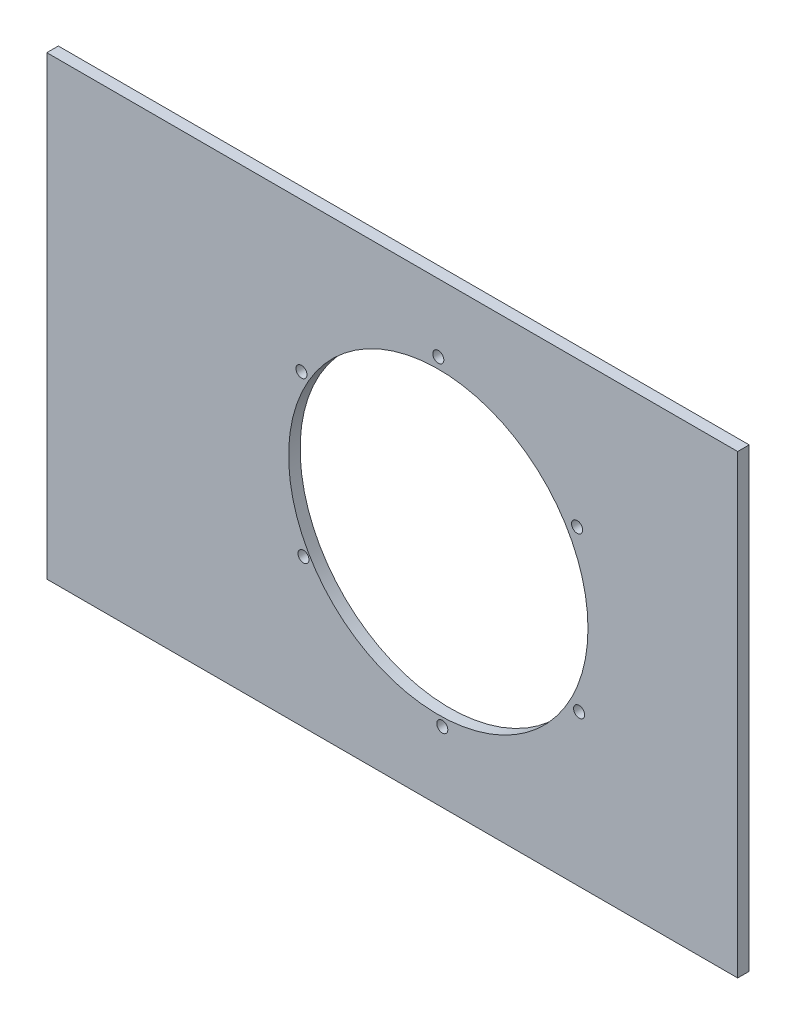
ISO-10303-21;
HEADER;
FILE_DESCRIPTION(('STEP AP214'),'2;1');
FILE_NAME('part.step','',(''),(''),'','','');
FILE_SCHEMA(('AUTOMOTIVE_DESIGN { 1 0 10303 214 1 1 1 1 }'));
ENDSEC;
DATA;
#1=APPLICATION_CONTEXT('core data for automotive mechanical design processes');
#2=APPLICATION_PROTOCOL_DEFINITION('international standard','automotive_design',2000,#1);
#3=PRODUCT_CONTEXT('',#1,'mechanical');
#4=PRODUCT('Part','Part','',(#3));
#5=PRODUCT_RELATED_PRODUCT_CATEGORY('part','',(#4));
#6=PRODUCT_DEFINITION_FORMATION('','',#4);
#7=PRODUCT_DEFINITION_CONTEXT('part definition',#1,'design');
#8=PRODUCT_DEFINITION('design','',#6,#7);
#9=PRODUCT_DEFINITION_SHAPE('','',#8);
#10=(LENGTH_UNIT() NAMED_UNIT(*) SI_UNIT(.MILLI.,.METRE.));
#11=(NAMED_UNIT(*) PLANE_ANGLE_UNIT() SI_UNIT($,.RADIAN.));
#12=(NAMED_UNIT(*) SI_UNIT($,.STERADIAN.) SOLID_ANGLE_UNIT());
#13=UNCERTAINTY_MEASURE_WITH_UNIT(LENGTH_MEASURE(1.E-05),#10,'distance_accuracy_value','');
#14=(GEOMETRIC_REPRESENTATION_CONTEXT(3) GLOBAL_UNCERTAINTY_ASSIGNED_CONTEXT((#13)) GLOBAL_UNIT_ASSIGNED_CONTEXT((#10,
#11,#12)) REPRESENTATION_CONTEXT('',''));
#15=CARTESIAN_POINT('',(0.,0.,0.));
#16=DIRECTION('',(0.,0.,1.));
#17=DIRECTION('',(1.,0.,0.));
#18=AXIS2_PLACEMENT_3D('',#15,#16,#17);
#19=CARTESIAN_POINT('',(0.,0.,6.35));
#20=DIRECTION('',(0.,0.,1.));
#21=DIRECTION('',(1.,0.,0.));
#22=AXIS2_PLACEMENT_3D('',#19,#20,#21);
#23=PLANE('',#22);
#24=CARTESIAN_POINT('',(-239.4500129657,81.5339999999987,6.35));
#25=DIRECTION('',(0.,0.,1.));
#26=DIRECTION('',(1.,0.,0.));
#27=AXIS2_PLACEMENT_3D('',#24,#25,#26);
#28=CIRCLE('',#27,3.04799999999998);
#29=CARTESIAN_POINT('',(-236.4020129657,81.5339999999987,6.35));
#30=VERTEX_POINT('',#29);
#31=EDGE_CURVE('E142',#30,#30,#28,.T.);
#32=ORIENTED_EDGE('',*,*,#31,.F.);
#33=EDGE_LOOP('',(#32));
#34=FACE_BOUND('',#33,.T.);
#35=CARTESIAN_POINT('',(-87.4504302458777,83.4390000000007,6.35));
#36=DIRECTION('',(0.,0.,1.));
#37=DIRECTION('',(1.,0.,0.));
#38=AXIS2_PLACEMENT_3D('',#35,#36,#37);
#39=CIRCLE('',#38,3.04800000000001);
#40=CARTESIAN_POINT('',(-84.4024302458777,83.4390000000007,6.35));
#41=VERTEX_POINT('',#40);
#42=EDGE_CURVE('E130',#41,#41,#39,.T.);
#43=ORIENTED_EDGE('',*,*,#42,.F.);
#44=EDGE_LOOP('',(#43));
#45=FACE_BOUND('',#44,.T.);
#46=CARTESIAN_POINT('',(-165.1,214.122,6.35));
#47=DIRECTION('',(0.,0.,1.));
#48=DIRECTION('',(1.,0.,0.));
#49=AXIS2_PLACEMENT_3D('',#46,#47,#48);
#50=CIRCLE('',#49,3.04799999999998);
#51=CARTESIAN_POINT('',(-162.052,214.122,6.35));
#52=VERTEX_POINT('',#51);
#53=EDGE_CURVE('E118',#52,#52,#50,.T.);
#54=ORIENTED_EDGE('',*,*,#53,.F.);
#55=EDGE_LOOP('',(#54));
#56=FACE_BOUND('',#55,.T.);
#57=DIRECTION('',(0.,1.,0.));
#58=VECTOR('',#57,1.);
#59=CARTESIAN_POINT('',(0.,0.,6.35));
#60=LINE('',#59,#58);
#61=CARTESIAN_POINT('',(0.,0.,6.35));
#62=VERTEX_POINT('',#61);
#63=CARTESIAN_POINT('',(0.,251.46,6.35));
#64=VERTEX_POINT('',#63);
#65=EDGE_CURVE('E88',#62,#64,#60,.T.);
#66=ORIENTED_EDGE('',*,*,#65,.T.);
#67=DIRECTION('',(-1.,0.,0.));
#68=VECTOR('',#67,1.);
#69=CARTESIAN_POINT('',(0.,251.46,6.35));
#70=LINE('',#69,#68);
#71=CARTESIAN_POINT('',(-381.,251.46,6.35));
#72=VERTEX_POINT('',#71);
#73=EDGE_CURVE('E83',#64,#72,#70,.T.);
#74=ORIENTED_EDGE('',*,*,#73,.T.);
#75=DIRECTION('',(0.,-1.,0.));
#76=VECTOR('',#75,1.);
#77=CARTESIAN_POINT('',(-381.,0.,6.35));
#78=LINE('',#77,#76);
#79=CARTESIAN_POINT('',(-381.,0.,6.35));
#80=VERTEX_POINT('',#79);
#81=EDGE_CURVE('E86',#72,#80,#78,.T.);
#82=ORIENTED_EDGE('',*,*,#81,.T.);
#83=DIRECTION('',(1.,0.,0.));
#84=VECTOR('',#83,1.);
#85=CARTESIAN_POINT('',(0.,0.,6.35));
#86=LINE('',#85,#84);
#87=EDGE_CURVE('E53',#80,#62,#86,.T.);
#88=ORIENTED_EDGE('',*,*,#87,.T.);
#89=EDGE_LOOP('',(#66,#74,#82,#88));
#90=FACE_BOUND('',#89,.T.);
#91=CARTESIAN_POINT('',(-165.1,125.73,6.35));
#92=DIRECTION('',(0.,0.,1.));
#93=DIRECTION('',(1.,0.,0.));
#94=AXIS2_PLACEMENT_3D('',#91,#92,#93);
#95=CIRCLE('',#94,82.55);
#96=CARTESIAN_POINT('',(-82.55,125.73,6.35));
#97=VERTEX_POINT('',#96);
#98=EDGE_CURVE('E103',#97,#97,#95,.T.);
#99=ORIENTED_EDGE('',*,*,#98,.F.);
#100=EDGE_LOOP('',(#99));
#101=FACE_BOUND('',#100,.T.);
#102=CARTESIAN_POINT('',(-88.5502825086851,171.196000000001,6.35));
#103=DIRECTION('',(0.,0.,1.));
#104=DIRECTION('',(1.,0.,0.));
#105=AXIS2_PLACEMENT_3D('',#102,#103,#104);
#106=CIRCLE('',#105,3.04799999999998);
#107=CARTESIAN_POINT('',(-85.5022825086852,171.196000000001,6.35));
#108=VERTEX_POINT('',#107);
#109=EDGE_CURVE('E124',#108,#108,#106,.T.);
#110=ORIENTED_EDGE('',*,*,#109,.F.);
#111=EDGE_LOOP('',(#110));
#112=FACE_BOUND('',#111,.T.);
#113=CARTESIAN_POINT('',(-162.900295474385,38.6079999999996,6.35));
#114=DIRECTION('',(0.,0.,1.));
#115=DIRECTION('',(1.,0.,0.));
#116=AXIS2_PLACEMENT_3D('',#113,#114,#115);
#117=CIRCLE('',#116,3.04799999999996);
#118=CARTESIAN_POINT('',(-159.852295474385,38.6079999999996,6.35));
#119=VERTEX_POINT('',#118);
#120=EDGE_CURVE('E136',#119,#119,#117,.T.);
#121=ORIENTED_EDGE('',*,*,#120,.F.);
#122=EDGE_LOOP('',(#121));
#123=FACE_BOUND('',#122,.T.);
#124=CARTESIAN_POINT('',(-240.549865228507,169.290999999999,6.35));
#125=DIRECTION('',(0.,0.,1.));
#126=DIRECTION('',(1.,0.,0.));
#127=AXIS2_PLACEMENT_3D('',#124,#125,#126);
#128=CIRCLE('',#127,3.04799999999995);
#129=CARTESIAN_POINT('',(-237.501865228507,169.290999999999,6.35));
#130=VERTEX_POINT('',#129);
#131=EDGE_CURVE('E148',#130,#130,#128,.T.);
#132=ORIENTED_EDGE('',*,*,#131,.F.);
#133=EDGE_LOOP('',(#132));
#134=FACE_BOUND('',#133,.T.);
#135=ADVANCED_FACE('F36',(#34,#45,#56,#90,#101,#112,#123,#134),#23,.T.);
#136=CARTESIAN_POINT('',(0.,0.,0.));
#137=DIRECTION('',(0.,0.,1.));
#138=DIRECTION('',(1.,0.,0.));
#139=AXIS2_PLACEMENT_3D('',#136,#137,#138);
#140=PLANE('',#139);
#141=DIRECTION('',(0.,1.,0.));
#142=VECTOR('',#141,1.);
#143=CARTESIAN_POINT('',(0.,0.,0.));
#144=LINE('',#143,#142);
#145=CARTESIAN_POINT('',(0.,0.,0.));
#146=VERTEX_POINT('',#145);
#147=CARTESIAN_POINT('',(0.,251.46,0.));
#148=VERTEX_POINT('',#147);
#149=EDGE_CURVE('E100',#146,#148,#144,.T.);
#150=ORIENTED_EDGE('',*,*,#149,.F.);
#151=DIRECTION('',(1.,0.,0.));
#152=VECTOR('',#151,1.);
#153=CARTESIAN_POINT('',(0.,0.,0.));
#154=LINE('',#153,#152);
#155=CARTESIAN_POINT('',(-381.,0.,0.));
#156=VERTEX_POINT('',#155);
#157=EDGE_CURVE('E76',#156,#146,#154,.T.);
#158=ORIENTED_EDGE('',*,*,#157,.F.);
#159=DIRECTION('',(0.,-1.,0.));
#160=VECTOR('',#159,1.);
#161=CARTESIAN_POINT('',(-381.,0.,0.));
#162=LINE('',#161,#160);
#163=CARTESIAN_POINT('',(-381.,251.46,0.));
#164=VERTEX_POINT('',#163);
#165=EDGE_CURVE('E70',#164,#156,#162,.T.);
#166=ORIENTED_EDGE('',*,*,#165,.F.);
#167=DIRECTION('',(-1.,0.,0.));
#168=VECTOR('',#167,1.);
#169=CARTESIAN_POINT('',(0.,251.46,0.));
#170=LINE('',#169,#168);
#171=EDGE_CURVE('E92',#148,#164,#170,.T.);
#172=ORIENTED_EDGE('',*,*,#171,.F.);
#173=EDGE_LOOP('',(#150,#158,#166,#172));
#174=FACE_BOUND('',#173,.T.);
#175=CARTESIAN_POINT('',(-165.1,125.73,0.));
#176=DIRECTION('',(0.,0.,1.));
#177=DIRECTION('',(1.,0.,0.));
#178=AXIS2_PLACEMENT_3D('',#175,#176,#177);
#179=CIRCLE('',#178,82.55);
#180=CARTESIAN_POINT('',(-82.55,125.73,0.));
#181=VERTEX_POINT('',#180);
#182=EDGE_CURVE('E115',#181,#181,#179,.T.);
#183=ORIENTED_EDGE('',*,*,#182,.T.);
#184=EDGE_LOOP('',(#183));
#185=FACE_BOUND('',#184,.T.);
#186=CARTESIAN_POINT('',(-165.1,214.122,0.));
#187=DIRECTION('',(0.,0.,1.));
#188=DIRECTION('',(1.,0.,0.));
#189=AXIS2_PLACEMENT_3D('',#186,#187,#188);
#190=CIRCLE('',#189,3.04799999999998);
#191=CARTESIAN_POINT('',(-162.052,214.122,0.));
#192=VERTEX_POINT('',#191);
#193=EDGE_CURVE('E121',#192,#192,#190,.T.);
#194=ORIENTED_EDGE('',*,*,#193,.T.);
#195=EDGE_LOOP('',(#194));
#196=FACE_BOUND('',#195,.T.);
#197=CARTESIAN_POINT('',(-88.5502825086851,171.196000000001,0.));
#198=DIRECTION('',(0.,0.,1.));
#199=DIRECTION('',(1.,0.,0.));
#200=AXIS2_PLACEMENT_3D('',#197,#198,#199);
#201=CIRCLE('',#200,3.04799999999998);
#202=CARTESIAN_POINT('',(-85.5022825086852,171.196000000001,0.));
#203=VERTEX_POINT('',#202);
#204=EDGE_CURVE('E127',#203,#203,#201,.T.);
#205=ORIENTED_EDGE('',*,*,#204,.T.);
#206=EDGE_LOOP('',(#205));
#207=FACE_BOUND('',#206,.T.);
#208=CARTESIAN_POINT('',(-87.4504302458777,83.4390000000007,0.));
#209=DIRECTION('',(0.,0.,1.));
#210=DIRECTION('',(1.,0.,0.));
#211=AXIS2_PLACEMENT_3D('',#208,#209,#210);
#212=CIRCLE('',#211,3.04800000000001);
#213=CARTESIAN_POINT('',(-84.4024302458777,83.4390000000007,0.));
#214=VERTEX_POINT('',#213);
#215=EDGE_CURVE('E133',#214,#214,#212,.T.);
#216=ORIENTED_EDGE('',*,*,#215,.T.);
#217=EDGE_LOOP('',(#216));
#218=FACE_BOUND('',#217,.T.);
#219=CARTESIAN_POINT('',(-162.900295474385,38.6079999999996,0.));
#220=DIRECTION('',(0.,0.,1.));
#221=DIRECTION('',(1.,0.,0.));
#222=AXIS2_PLACEMENT_3D('',#219,#220,#221);
#223=CIRCLE('',#222,3.04799999999996);
#224=CARTESIAN_POINT('',(-159.852295474385,38.6079999999996,0.));
#225=VERTEX_POINT('',#224);
#226=EDGE_CURVE('E139',#225,#225,#223,.T.);
#227=ORIENTED_EDGE('',*,*,#226,.T.);
#228=EDGE_LOOP('',(#227));
#229=FACE_BOUND('',#228,.T.);
#230=CARTESIAN_POINT('',(-239.4500129657,81.5339999999987,0.));
#231=DIRECTION('',(0.,0.,1.));
#232=DIRECTION('',(1.,0.,0.));
#233=AXIS2_PLACEMENT_3D('',#230,#231,#232);
#234=CIRCLE('',#233,3.04799999999998);
#235=CARTESIAN_POINT('',(-236.4020129657,81.5339999999987,0.));
#236=VERTEX_POINT('',#235);
#237=EDGE_CURVE('E145',#236,#236,#234,.T.);
#238=ORIENTED_EDGE('',*,*,#237,.T.);
#239=EDGE_LOOP('',(#238));
#240=FACE_BOUND('',#239,.T.);
#241=CARTESIAN_POINT('',(-240.549865228507,169.290999999999,0.));
#242=DIRECTION('',(0.,0.,1.));
#243=DIRECTION('',(1.,0.,0.));
#244=AXIS2_PLACEMENT_3D('',#241,#242,#243);
#245=CIRCLE('',#244,3.04799999999995);
#246=CARTESIAN_POINT('',(-237.501865228507,169.290999999999,0.));
#247=VERTEX_POINT('',#246);
#248=EDGE_CURVE('E151',#247,#247,#245,.T.);
#249=ORIENTED_EDGE('',*,*,#248,.T.);
#250=EDGE_LOOP('',(#249));
#251=FACE_BOUND('',#250,.T.);
#252=ADVANCED_FACE('F111',(#174,#185,#196,#207,#218,#229,#240,#251),#140,.F.);
#253=CARTESIAN_POINT('',(0.,0.,6.35));
#254=DIRECTION('',(-1.,0.,0.));
#255=DIRECTION('',(0.,0.,1.));
#256=AXIS2_PLACEMENT_3D('',#253,#254,#255);
#257=PLANE('',#256);
#258=ORIENTED_EDGE('',*,*,#149,.T.);
#259=DIRECTION('',(0.,0.,-1.));
#260=VECTOR('',#259,1.);
#261=CARTESIAN_POINT('',(0.,251.46,6.35));
#262=LINE('',#261,#260);
#263=EDGE_CURVE('E11',#64,#148,#262,.T.);
#264=ORIENTED_EDGE('',*,*,#263,.F.);
#265=ORIENTED_EDGE('',*,*,#65,.F.);
#266=DIRECTION('',(0.,0.,-1.));
#267=VECTOR('',#266,1.);
#268=CARTESIAN_POINT('',(0.,0.,6.35));
#269=LINE('',#268,#267);
#270=EDGE_CURVE('E96',#62,#146,#269,.T.);
#271=ORIENTED_EDGE('',*,*,#270,.T.);
#272=EDGE_LOOP('',(#258,#264,#265,#271));
#273=FACE_BOUND('',#272,.T.);
#274=ADVANCED_FACE('F38',(#273),#257,.F.);
#275=CARTESIAN_POINT('',(0.,251.46,6.35));
#276=DIRECTION('',(0.,-1.,0.));
#277=DIRECTION('',(1.,0.,0.));
#278=AXIS2_PLACEMENT_3D('',#275,#276,#277);
#279=PLANE('',#278);
#280=ORIENTED_EDGE('',*,*,#171,.T.);
#281=DIRECTION('',(0.,0.,-1.));
#282=VECTOR('',#281,1.);
#283=CARTESIAN_POINT('',(-381.,251.46,6.35));
#284=LINE('',#283,#282);
#285=EDGE_CURVE('E45',#72,#164,#284,.T.);
#286=ORIENTED_EDGE('',*,*,#285,.F.);
#287=ORIENTED_EDGE('',*,*,#73,.F.);
#288=ORIENTED_EDGE('',*,*,#263,.T.);
#289=EDGE_LOOP('',(#280,#286,#287,#288));
#290=FACE_BOUND('',#289,.T.);
#291=ADVANCED_FACE('F91',(#290),#279,.F.);
#292=CARTESIAN_POINT('',(-381.,0.,6.35));
#293=DIRECTION('',(1.,0.,0.));
#294=DIRECTION('',(0.,0.,-1.));
#295=AXIS2_PLACEMENT_3D('',#292,#293,#294);
#296=PLANE('',#295);
#297=ORIENTED_EDGE('',*,*,#165,.T.);
#298=DIRECTION('',(0.,0.,-1.));
#299=VECTOR('',#298,1.);
#300=CARTESIAN_POINT('',(-381.,0.,6.35));
#301=LINE('',#300,#299);
#302=EDGE_CURVE('E93',#80,#156,#301,.T.);
#303=ORIENTED_EDGE('',*,*,#302,.F.);
#304=ORIENTED_EDGE('',*,*,#81,.F.);
#305=ORIENTED_EDGE('',*,*,#285,.T.);
#306=EDGE_LOOP('',(#297,#303,#304,#305));
#307=FACE_BOUND('',#306,.T.);
#308=ADVANCED_FACE('F94',(#307),#296,.F.);
#309=CARTESIAN_POINT('',(0.,0.,6.35));
#310=DIRECTION('',(0.,1.,0.));
#311=DIRECTION('',(-1.,0.,0.));
#312=AXIS2_PLACEMENT_3D('',#309,#310,#311);
#313=PLANE('',#312);
#314=ORIENTED_EDGE('',*,*,#157,.T.);
#315=ORIENTED_EDGE('',*,*,#270,.F.);
#316=ORIENTED_EDGE('',*,*,#87,.F.);
#317=ORIENTED_EDGE('',*,*,#302,.T.);
#318=EDGE_LOOP('',(#314,#315,#316,#317));
#319=FACE_BOUND('',#318,.T.);
#320=ADVANCED_FACE('F108',(#319),#313,.F.);
#321=CARTESIAN_POINT('',(-165.1,125.73,6.35));
#322=DIRECTION('',(0.,0.,-1.));
#323=DIRECTION('',(-1.,0.,0.));
#324=AXIS2_PLACEMENT_3D('',#321,#322,#323);
#325=CYLINDRICAL_SURFACE('',#324,82.55);
#326=ORIENTED_EDGE('',*,*,#98,.T.);
#327=EDGE_LOOP('',(#326));
#328=FACE_BOUND('',#327,.T.);
#329=ORIENTED_EDGE('',*,*,#182,.F.);
#330=EDGE_LOOP('',(#329));
#331=FACE_BOUND('',#330,.T.);
#332=ADVANCED_FACE('F170',(#328,#331),#325,.F.);
#333=CARTESIAN_POINT('',(-165.1,214.122,6.35));
#334=DIRECTION('',(0.,0.,-1.));
#335=DIRECTION('',(-1.,0.,0.));
#336=AXIS2_PLACEMENT_3D('',#333,#334,#335);
#337=CYLINDRICAL_SURFACE('',#336,3.04799999999998);
#338=ORIENTED_EDGE('',*,*,#53,.T.);
#339=EDGE_LOOP('',(#338));
#340=FACE_BOUND('',#339,.T.);
#341=ORIENTED_EDGE('',*,*,#193,.F.);
#342=EDGE_LOOP('',(#341));
#343=FACE_BOUND('',#342,.T.);
#344=ADVANCED_FACE('F224',(#340,#343),#337,.F.);
#345=CARTESIAN_POINT('',(-88.5502825086851,171.196000000001,6.35));
#346=DIRECTION('',(0.,0.,-1.));
#347=DIRECTION('',(-1.,0.,0.));
#348=AXIS2_PLACEMENT_3D('',#345,#346,#347);
#349=CYLINDRICAL_SURFACE('',#348,3.04799999999998);
#350=ORIENTED_EDGE('',*,*,#109,.T.);
#351=EDGE_LOOP('',(#350));
#352=FACE_BOUND('',#351,.T.);
#353=ORIENTED_EDGE('',*,*,#204,.F.);
#354=EDGE_LOOP('',(#353));
#355=FACE_BOUND('',#354,.T.);
#356=ADVANCED_FACE('F233',(#352,#355),#349,.F.);
#357=CARTESIAN_POINT('',(-87.4504302458777,83.4390000000007,6.35));
#358=DIRECTION('',(0.,0.,-1.));
#359=DIRECTION('',(-1.,0.,0.));
#360=AXIS2_PLACEMENT_3D('',#357,#358,#359);
#361=CYLINDRICAL_SURFACE('',#360,3.04800000000001);
#362=ORIENTED_EDGE('',*,*,#42,.T.);
#363=EDGE_LOOP('',(#362));
#364=FACE_BOUND('',#363,.T.);
#365=ORIENTED_EDGE('',*,*,#215,.F.);
#366=EDGE_LOOP('',(#365));
#367=FACE_BOUND('',#366,.T.);
#368=ADVANCED_FACE('F242',(#364,#367),#361,.F.);
#369=CARTESIAN_POINT('',(-162.900295474385,38.6079999999996,6.35));
#370=DIRECTION('',(0.,0.,-1.));
#371=DIRECTION('',(-1.,0.,0.));
#372=AXIS2_PLACEMENT_3D('',#369,#370,#371);
#373=CYLINDRICAL_SURFACE('',#372,3.04799999999996);
#374=ORIENTED_EDGE('',*,*,#120,.T.);
#375=EDGE_LOOP('',(#374));
#376=FACE_BOUND('',#375,.T.);
#377=ORIENTED_EDGE('',*,*,#226,.F.);
#378=EDGE_LOOP('',(#377));
#379=FACE_BOUND('',#378,.T.);
#380=ADVANCED_FACE('F252',(#376,#379),#373,.F.);
#381=CARTESIAN_POINT('',(-239.4500129657,81.5339999999987,6.35));
#382=DIRECTION('',(0.,0.,-1.));
#383=DIRECTION('',(-1.,0.,0.));
#384=AXIS2_PLACEMENT_3D('',#381,#382,#383);
#385=CYLINDRICAL_SURFACE('',#384,3.04799999999998);
#386=ORIENTED_EDGE('',*,*,#31,.T.);
#387=EDGE_LOOP('',(#386));
#388=FACE_BOUND('',#387,.T.);
#389=ORIENTED_EDGE('',*,*,#237,.F.);
#390=EDGE_LOOP('',(#389));
#391=FACE_BOUND('',#390,.T.);
#392=ADVANCED_FACE('F262',(#388,#391),#385,.F.);
#393=CARTESIAN_POINT('',(-240.549865228507,169.290999999999,6.35));
#394=DIRECTION('',(0.,0.,-1.));
#395=DIRECTION('',(-1.,0.,0.));
#396=AXIS2_PLACEMENT_3D('',#393,#394,#395);
#397=CYLINDRICAL_SURFACE('',#396,3.04799999999995);
#398=ORIENTED_EDGE('',*,*,#131,.T.);
#399=EDGE_LOOP('',(#398));
#400=FACE_BOUND('',#399,.T.);
#401=ORIENTED_EDGE('',*,*,#248,.F.);
#402=EDGE_LOOP('',(#401));
#403=FACE_BOUND('',#402,.T.);
#404=ADVANCED_FACE('F157',(#400,#403),#397,.F.);
#405=CLOSED_SHELL('',(#135,#252,#274,#291,#308,#320,#332,#344,#356,#368,#380,#392,#404));
#406=MANIFOLD_SOLID_BREP('B2',#405);
#407=ADVANCED_BREP_SHAPE_REPRESENTATION('',(#18,#406),#14);
#408=SHAPE_DEFINITION_REPRESENTATION(#9,#407);
ENDSEC;
END-ISO-10303-21;
